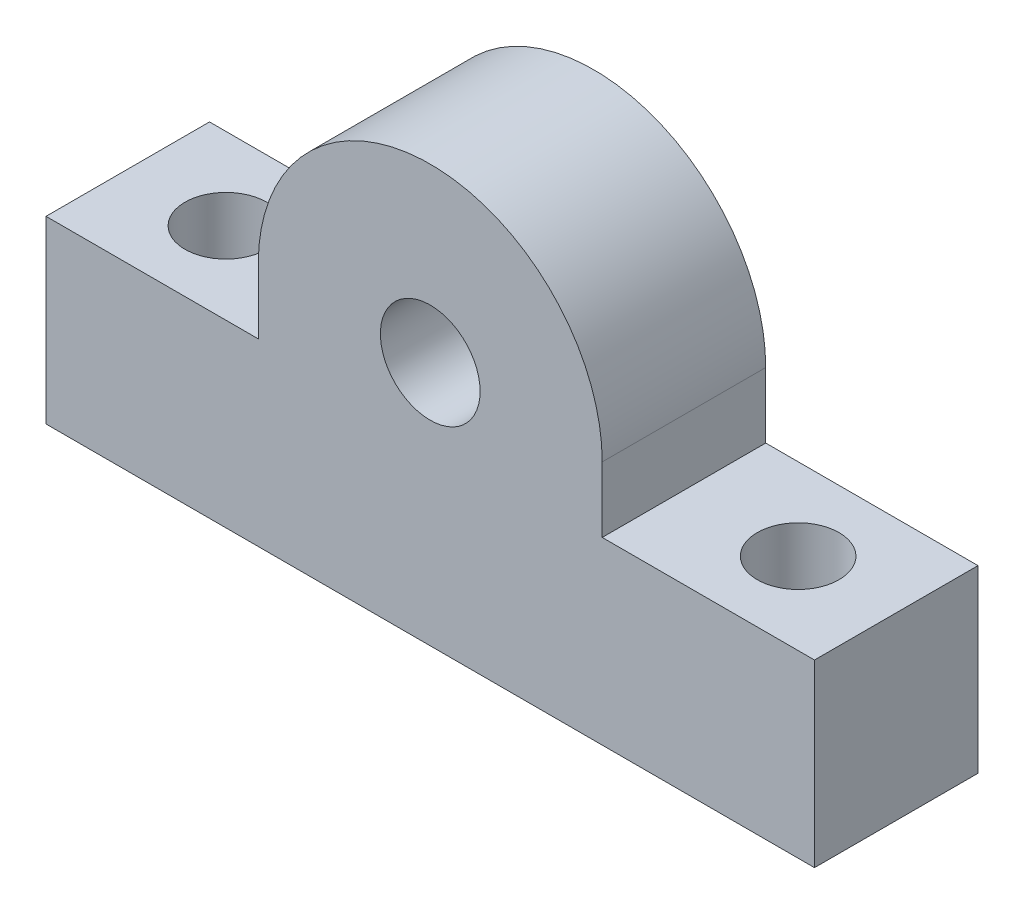
ISO-10303-21;
HEADER;
FILE_DESCRIPTION(('STEP AP214'),'2;1');
FILE_NAME('part.step','',(''),(''),'','','');
FILE_SCHEMA(('AUTOMOTIVE_DESIGN { 1 0 10303 214 1 1 1 1 }'));
ENDSEC;
DATA;
#1=APPLICATION_CONTEXT('core data for automotive mechanical design processes');
#2=APPLICATION_PROTOCOL_DEFINITION('international standard','automotive_design',2000,#1);
#3=PRODUCT_CONTEXT('',#1,'mechanical');
#4=PRODUCT('Part','Part','',(#3));
#5=PRODUCT_RELATED_PRODUCT_CATEGORY('part','',(#4));
#6=PRODUCT_DEFINITION_FORMATION('','',#4);
#7=PRODUCT_DEFINITION_CONTEXT('part definition',#1,'design');
#8=PRODUCT_DEFINITION('design','',#6,#7);
#9=PRODUCT_DEFINITION_SHAPE('','',#8);
#10=(LENGTH_UNIT() NAMED_UNIT(*) SI_UNIT(.MILLI.,.METRE.));
#11=(NAMED_UNIT(*) PLANE_ANGLE_UNIT() SI_UNIT($,.RADIAN.));
#12=(NAMED_UNIT(*) SI_UNIT($,.STERADIAN.) SOLID_ANGLE_UNIT());
#13=UNCERTAINTY_MEASURE_WITH_UNIT(LENGTH_MEASURE(1.E-05),#10,'distance_accuracy_value','');
#14=(GEOMETRIC_REPRESENTATION_CONTEXT(3) GLOBAL_UNCERTAINTY_ASSIGNED_CONTEXT((#13)) GLOBAL_UNIT_ASSIGNED_CONTEXT((#10,
#11,#12)) REPRESENTATION_CONTEXT('',''));
#15=CARTESIAN_POINT('',(0.,0.,0.));
#16=DIRECTION('',(0.,0.,1.));
#17=DIRECTION('',(1.,0.,0.));
#18=AXIS2_PLACEMENT_3D('',#15,#16,#17);
#19=CARTESIAN_POINT('',(-23.5,5.5,10.));
#20=DIRECTION('',(0.,-1.,0.));
#21=DIRECTION('',(0.,0.,-1.));
#22=AXIS2_PLACEMENT_3D('',#19,#20,#21);
#23=PLANE('',#22);
#24=CARTESIAN_POINT('',(-17.5,5.5,5.));
#25=DIRECTION('',(0.,-1.,0.));
#26=DIRECTION('',(0.,0.,-1.));
#27=AXIS2_PLACEMENT_3D('',#24,#25,#26);
#28=CIRCLE('',#27,2.5);
#29=CARTESIAN_POINT('',(-17.5,5.5,2.5));
#30=VERTEX_POINT('',#29);
#31=EDGE_CURVE('E158',#30,#30,#28,.F.);
#32=ORIENTED_EDGE('',*,*,#31,.F.);
#33=EDGE_LOOP('',(#32));
#34=FACE_BOUND('',#33,.T.);
#35=DIRECTION('',(0.,0.,1.));
#36=VECTOR('',#35,1.);
#37=CARTESIAN_POINT('',(-10.5173777166829,5.5,0.));
#38=LINE('',#37,#36);
#39=CARTESIAN_POINT('',(-10.5173777166829,5.5,0.));
#40=VERTEX_POINT('',#39);
#41=CARTESIAN_POINT('',(-10.5173777166829,5.5,10.));
#42=VERTEX_POINT('',#41);
#43=EDGE_CURVE('E152',#40,#42,#38,.T.);
#44=ORIENTED_EDGE('',*,*,#43,.F.);
#45=DIRECTION('',(-1.,0.,0.));
#46=VECTOR('',#45,1.);
#47=CARTESIAN_POINT('',(-23.5,5.5,0.));
#48=LINE('',#47,#46);
#49=CARTESIAN_POINT('',(-23.5,5.5,0.));
#50=VERTEX_POINT('',#49);
#51=EDGE_CURVE('E177',#40,#50,#48,.T.);
#52=ORIENTED_EDGE('',*,*,#51,.T.);
#53=DIRECTION('',(0.,0.,-1.));
#54=VECTOR('',#53,1.);
#55=CARTESIAN_POINT('',(-23.5,5.5,10.));
#56=LINE('',#55,#54);
#57=CARTESIAN_POINT('',(-23.5,5.5,10.));
#58=VERTEX_POINT('',#57);
#59=EDGE_CURVE('E49',#58,#50,#56,.T.);
#60=ORIENTED_EDGE('',*,*,#59,.F.);
#61=DIRECTION('',(-1.,0.,0.));
#62=VECTOR('',#61,1.);
#63=CARTESIAN_POINT('',(-23.5,5.5,10.));
#64=LINE('',#63,#62);
#65=EDGE_CURVE('E169',#42,#58,#64,.T.);
#66=ORIENTED_EDGE('',*,*,#65,.F.);
#67=EDGE_LOOP('',(#44,#52,#60,#66));
#68=FACE_BOUND('',#67,.T.);
#69=ADVANCED_FACE('F41',(#34,#68),#23,.F.);
#70=CARTESIAN_POINT('',(23.5,5.5,0.));
#71=VERTEX_POINT('',#70);
#72=CARTESIAN_POINT('',(10.5173777166829,5.5,0.));
#73=VERTEX_POINT('',#72);
#74=EDGE_CURVE('E178',#71,#73,#48,.T.);
#75=ORIENTED_EDGE('',*,*,#74,.T.);
#76=DIRECTION('',(0.,0.,1.));
#77=VECTOR('',#76,1.);
#78=CARTESIAN_POINT('',(10.5173777166829,5.5,0.));
#79=LINE('',#78,#77);
#80=CARTESIAN_POINT('',(10.5173777166829,5.5,10.));
#81=VERTEX_POINT('',#80);
#82=EDGE_CURVE('E128',#73,#81,#79,.T.);
#83=ORIENTED_EDGE('',*,*,#82,.T.);
#84=CARTESIAN_POINT('',(23.5,5.5,10.));
#85=VERTEX_POINT('',#84);
#86=EDGE_CURVE('E92',#85,#81,#64,.T.);
#87=ORIENTED_EDGE('',*,*,#86,.F.);
#88=DIRECTION('',(0.,0.,-1.));
#89=VECTOR('',#88,1.);
#90=CARTESIAN_POINT('',(23.5,5.5,10.));
#91=LINE('',#90,#89);
#92=EDGE_CURVE('E11',#85,#71,#91,.T.);
#93=ORIENTED_EDGE('',*,*,#92,.T.);
#94=EDGE_LOOP('',(#75,#83,#87,#93));
#95=FACE_BOUND('',#94,.T.);
#96=CARTESIAN_POINT('',(17.5,5.5,5.));
#97=DIRECTION('',(0.,-1.,0.));
#98=DIRECTION('',(0.,0.,-1.));
#99=AXIS2_PLACEMENT_3D('',#96,#97,#98);
#100=CIRCLE('',#99,2.5);
#101=CARTESIAN_POINT('',(17.5,5.5,2.5));
#102=VERTEX_POINT('',#101);
#103=EDGE_CURVE('E151',#102,#102,#100,.T.);
#104=ORIENTED_EDGE('',*,*,#103,.T.);
#105=EDGE_LOOP('',(#104));
#106=FACE_BOUND('',#105,.T.);
#107=ADVANCED_FACE('F200',(#95,#106),#23,.F.);
#108=CARTESIAN_POINT('',(-23.5,-5.5,10.));
#109=DIRECTION('',(0.,1.,0.));
#110=DIRECTION('',(0.,0.,1.));
#111=AXIS2_PLACEMENT_3D('',#108,#109,#110);
#112=PLANE('',#111);
#113=DIRECTION('',(1.,0.,0.));
#114=VECTOR('',#113,1.);
#115=CARTESIAN_POINT('',(-23.5,-5.5,0.));
#116=LINE('',#115,#114);
#117=CARTESIAN_POINT('',(-23.5,-5.5,0.));
#118=VERTEX_POINT('',#117);
#119=CARTESIAN_POINT('',(23.5,-5.5,0.));
#120=VERTEX_POINT('',#119);
#121=EDGE_CURVE('E86',#118,#120,#116,.T.);
#122=ORIENTED_EDGE('',*,*,#121,.T.);
#123=DIRECTION('',(0.,0.,-1.));
#124=VECTOR('',#123,1.);
#125=CARTESIAN_POINT('',(23.5,-5.5,10.));
#126=LINE('',#125,#124);
#127=CARTESIAN_POINT('',(23.5,-5.5,10.));
#128=VERTEX_POINT('',#127);
#129=EDGE_CURVE('E174',#128,#120,#126,.T.);
#130=ORIENTED_EDGE('',*,*,#129,.F.);
#131=DIRECTION('',(1.,0.,0.));
#132=VECTOR('',#131,1.);
#133=CARTESIAN_POINT('',(-23.5,-5.5,10.));
#134=LINE('',#133,#132);
#135=CARTESIAN_POINT('',(-23.5,-5.5,10.));
#136=VERTEX_POINT('',#135);
#137=EDGE_CURVE('E65',#136,#128,#134,.T.);
#138=ORIENTED_EDGE('',*,*,#137,.F.);
#139=DIRECTION('',(0.,0.,-1.));
#140=VECTOR('',#139,1.);
#141=CARTESIAN_POINT('',(-23.5,-5.5,10.));
#142=LINE('',#141,#140);
#143=EDGE_CURVE('E184',#136,#118,#142,.T.);
#144=ORIENTED_EDGE('',*,*,#143,.T.);
#145=EDGE_LOOP('',(#122,#130,#138,#144));
#146=FACE_BOUND('',#145,.T.);
#147=CARTESIAN_POINT('',(17.5,-5.5,5.));
#148=DIRECTION('',(0.,-1.,0.));
#149=DIRECTION('',(0.,0.,-1.));
#150=AXIS2_PLACEMENT_3D('',#147,#148,#149);
#151=CIRCLE('',#150,2.5);
#152=CARTESIAN_POINT('',(17.5,-5.5,2.5));
#153=VERTEX_POINT('',#152);
#154=EDGE_CURVE('E159',#153,#153,#151,.F.);
#155=ORIENTED_EDGE('',*,*,#154,.T.);
#156=EDGE_LOOP('',(#155));
#157=FACE_BOUND('',#156,.T.);
#158=CARTESIAN_POINT('',(-17.5,-5.5,5.));
#159=DIRECTION('',(0.,-1.,0.));
#160=DIRECTION('',(0.,0.,-1.));
#161=AXIS2_PLACEMENT_3D('',#158,#159,#160);
#162=CIRCLE('',#161,2.5);
#163=CARTESIAN_POINT('',(-17.5,-5.5,2.5));
#164=VERTEX_POINT('',#163);
#165=EDGE_CURVE('E155',#164,#164,#162,.T.);
#166=ORIENTED_EDGE('',*,*,#165,.F.);
#167=EDGE_LOOP('',(#166));
#168=FACE_BOUND('',#167,.T.);
#169=ADVANCED_FACE('F197',(#146,#157,#168),#112,.F.);
#170=CARTESIAN_POINT('',(23.5,5.5,10.));
#171=DIRECTION('',(-1.,0.,0.));
#172=DIRECTION('',(0.,0.,1.));
#173=AXIS2_PLACEMENT_3D('',#170,#171,#172);
#174=PLANE('',#173);
#175=DIRECTION('',(0.,1.,0.));
#176=VECTOR('',#175,1.);
#177=CARTESIAN_POINT('',(23.5,5.5,0.));
#178=LINE('',#177,#176);
#179=EDGE_CURVE('E162',#120,#71,#178,.T.);
#180=ORIENTED_EDGE('',*,*,#179,.T.);
#181=ORIENTED_EDGE('',*,*,#92,.F.);
#182=DIRECTION('',(0.,1.,0.));
#183=VECTOR('',#182,1.);
#184=CARTESIAN_POINT('',(23.5,5.5,10.));
#185=LINE('',#184,#183);
#186=EDGE_CURVE('E167',#128,#85,#185,.T.);
#187=ORIENTED_EDGE('',*,*,#186,.F.);
#188=ORIENTED_EDGE('',*,*,#129,.T.);
#189=EDGE_LOOP('',(#180,#181,#187,#188));
#190=FACE_BOUND('',#189,.T.);
#191=ADVANCED_FACE('F43',(#190),#174,.F.);
#192=CARTESIAN_POINT('',(-23.5,5.5,10.));
#193=DIRECTION('',(1.,0.,0.));
#194=DIRECTION('',(0.,0.,-1.));
#195=AXIS2_PLACEMENT_3D('',#192,#193,#194);
#196=PLANE('',#195);
#197=DIRECTION('',(0.,-1.,0.));
#198=VECTOR('',#197,1.);
#199=CARTESIAN_POINT('',(-23.5,5.5,0.));
#200=LINE('',#199,#198);
#201=EDGE_CURVE('E180',#50,#118,#200,.T.);
#202=ORIENTED_EDGE('',*,*,#201,.T.);
#203=ORIENTED_EDGE('',*,*,#143,.F.);
#204=DIRECTION('',(0.,-1.,0.));
#205=VECTOR('',#204,1.);
#206=CARTESIAN_POINT('',(-23.5,5.5,10.));
#207=LINE('',#206,#205);
#208=EDGE_CURVE('E171',#58,#136,#207,.T.);
#209=ORIENTED_EDGE('',*,*,#208,.F.);
#210=ORIENTED_EDGE('',*,*,#59,.T.);
#211=EDGE_LOOP('',(#202,#203,#209,#210));
#212=FACE_BOUND('',#211,.T.);
#213=ADVANCED_FACE('F190',(#212),#196,.F.);
#214=CARTESIAN_POINT('',(0.,0.,10.));
#215=DIRECTION('',(0.,0.,1.));
#216=DIRECTION('',(1.,0.,0.));
#217=AXIS2_PLACEMENT_3D('',#214,#215,#216);
#218=PLANE('',#217);
#219=ORIENTED_EDGE('',*,*,#186,.T.);
#220=ORIENTED_EDGE('',*,*,#86,.T.);
#221=DIRECTION('',(0.,-1.,0.));
#222=VECTOR('',#221,1.);
#223=CARTESIAN_POINT('',(10.5173777166829,0.,10.));
#224=LINE('',#223,#222);
#225=CARTESIAN_POINT('',(10.5173777166829,9.5,10.));
#226=VERTEX_POINT('',#225);
#227=EDGE_CURVE('E56',#226,#81,#224,.T.);
#228=ORIENTED_EDGE('',*,*,#227,.F.);
#229=CARTESIAN_POINT('',(0.,9.5,10.));
#230=DIRECTION('',(0.,0.,1.));
#231=DIRECTION('',(1.,0.,0.));
#232=AXIS2_PLACEMENT_3D('',#229,#230,#231);
#233=CIRCLE('',#232,10.5173777166829);
#234=CARTESIAN_POINT('',(-10.5173777166829,9.5,10.));
#235=VERTEX_POINT('',#234);
#236=EDGE_CURVE('E122',#226,#235,#233,.T.);
#237=ORIENTED_EDGE('',*,*,#236,.T.);
#238=DIRECTION('',(0.,-1.,0.));
#239=VECTOR('',#238,1.);
#240=CARTESIAN_POINT('',(-10.5173777166829,0.,10.));
#241=LINE('',#240,#239);
#242=EDGE_CURVE('E147',#235,#42,#241,.T.);
#243=ORIENTED_EDGE('',*,*,#242,.T.);
#244=ORIENTED_EDGE('',*,*,#65,.T.);
#245=ORIENTED_EDGE('',*,*,#208,.T.);
#246=ORIENTED_EDGE('',*,*,#137,.T.);
#247=EDGE_LOOP('',(#219,#220,#228,#237,#243,#244,#245,#246));
#248=FACE_BOUND('',#247,.T.);
#249=CARTESIAN_POINT('',(0.,9.5,10.));
#250=DIRECTION('',(0.,0.,1.));
#251=DIRECTION('',(1.,0.,0.));
#252=AXIS2_PLACEMENT_3D('',#249,#250,#251);
#253=CIRCLE('',#252,3.05);
#254=CARTESIAN_POINT('',(3.05,9.5,10.));
#255=VERTEX_POINT('',#254);
#256=EDGE_CURVE('E142',#255,#255,#253,.T.);
#257=ORIENTED_EDGE('',*,*,#256,.F.);
#258=EDGE_LOOP('',(#257));
#259=FACE_BOUND('',#258,.T.);
#260=ADVANCED_FACE('F218',(#248,#259),#218,.T.);
#261=CARTESIAN_POINT('',(0.,0.,0.));
#262=DIRECTION('',(0.,0.,1.));
#263=DIRECTION('',(1.,0.,0.));
#264=AXIS2_PLACEMENT_3D('',#261,#262,#263);
#265=PLANE('',#264);
#266=ORIENTED_EDGE('',*,*,#179,.F.);
#267=ORIENTED_EDGE('',*,*,#121,.F.);
#268=ORIENTED_EDGE('',*,*,#201,.F.);
#269=ORIENTED_EDGE('',*,*,#51,.F.);
#270=DIRECTION('',(0.,-1.,0.));
#271=VECTOR('',#270,1.);
#272=CARTESIAN_POINT('',(-10.5173777166829,0.,0.));
#273=LINE('',#272,#271);
#274=CARTESIAN_POINT('',(-10.5173777166829,9.5,0.));
#275=VERTEX_POINT('',#274);
#276=EDGE_CURVE('E124',#275,#40,#273,.T.);
#277=ORIENTED_EDGE('',*,*,#276,.F.);
#278=CARTESIAN_POINT('',(0.,9.5,0.));
#279=DIRECTION('',(0.,0.,1.));
#280=DIRECTION('',(1.,0.,0.));
#281=AXIS2_PLACEMENT_3D('',#278,#279,#280);
#282=CIRCLE('',#281,10.5173777166829);
#283=CARTESIAN_POINT('',(10.5173777166829,9.5,0.));
#284=VERTEX_POINT('',#283);
#285=EDGE_CURVE('E120',#284,#275,#282,.T.);
#286=ORIENTED_EDGE('',*,*,#285,.F.);
#287=DIRECTION('',(0.,-1.,0.));
#288=VECTOR('',#287,1.);
#289=CARTESIAN_POINT('',(10.5173777166829,0.,0.));
#290=LINE('',#289,#288);
#291=EDGE_CURVE('E126',#284,#73,#290,.T.);
#292=ORIENTED_EDGE('',*,*,#291,.T.);
#293=ORIENTED_EDGE('',*,*,#74,.F.);
#294=EDGE_LOOP('',(#266,#267,#268,#269,#277,#286,#292,#293));
#295=FACE_BOUND('',#294,.T.);
#296=CARTESIAN_POINT('',(0.,9.5,0.));
#297=DIRECTION('',(0.,0.,1.));
#298=DIRECTION('',(1.,0.,0.));
#299=AXIS2_PLACEMENT_3D('',#296,#297,#298);
#300=CIRCLE('',#299,3.05);
#301=CARTESIAN_POINT('',(3.05,9.5,0.));
#302=VERTEX_POINT('',#301);
#303=EDGE_CURVE('E131',#302,#302,#300,.T.);
#304=ORIENTED_EDGE('',*,*,#303,.T.);
#305=EDGE_LOOP('',(#304));
#306=FACE_BOUND('',#305,.T.);
#307=ADVANCED_FACE('F135',(#295,#306),#265,.F.);
#308=CARTESIAN_POINT('',(17.5,5.501,5.));
#309=DIRECTION('',(0.,-1.,0.));
#310=DIRECTION('',(0.,0.,-1.));
#311=AXIS2_PLACEMENT_3D('',#308,#309,#310);
#312=CYLINDRICAL_SURFACE('',#311,2.5);
#313=ORIENTED_EDGE('',*,*,#154,.F.);
#314=EDGE_LOOP('',(#313));
#315=FACE_BOUND('',#314,.T.);
#316=ORIENTED_EDGE('',*,*,#103,.F.);
#317=EDGE_LOOP('',(#316));
#318=FACE_BOUND('',#317,.T.);
#319=ADVANCED_FACE('F209',(#315,#318),#312,.F.);
#320=CARTESIAN_POINT('',(-17.5,5.501,5.));
#321=DIRECTION('',(0.,-1.,0.));
#322=DIRECTION('',(0.,0.,-1.));
#323=AXIS2_PLACEMENT_3D('',#320,#321,#322);
#324=CYLINDRICAL_SURFACE('',#323,2.5);
#325=ORIENTED_EDGE('',*,*,#165,.T.);
#326=EDGE_LOOP('',(#325));
#327=FACE_BOUND('',#326,.T.);
#328=ORIENTED_EDGE('',*,*,#31,.T.);
#329=EDGE_LOOP('',(#328));
#330=FACE_BOUND('',#329,.T.);
#331=ADVANCED_FACE('F206',(#327,#330),#324,.F.);
#332=CARTESIAN_POINT('',(10.5173777166829,0.,0.));
#333=DIRECTION('',(-1.,0.,0.));
#334=DIRECTION('',(0.,-1.,0.));
#335=AXIS2_PLACEMENT_3D('',#332,#333,#334);
#336=PLANE('',#335);
#337=ORIENTED_EDGE('',*,*,#227,.T.);
#338=ORIENTED_EDGE('',*,*,#82,.F.);
#339=ORIENTED_EDGE('',*,*,#291,.F.);
#340=DIRECTION('',(0.,0.,1.));
#341=VECTOR('',#340,1.);
#342=CARTESIAN_POINT('',(10.5173777166829,9.5,0.));
#343=LINE('',#342,#341);
#344=EDGE_CURVE('E116',#284,#226,#343,.T.);
#345=ORIENTED_EDGE('',*,*,#344,.T.);
#346=EDGE_LOOP('',(#337,#338,#339,#345));
#347=FACE_BOUND('',#346,.T.);
#348=ADVANCED_FACE('F127',(#347),#336,.F.);
#349=CARTESIAN_POINT('',(-10.5173777166829,0.,0.));
#350=DIRECTION('',(-1.,0.,0.));
#351=DIRECTION('',(0.,-1.,0.));
#352=AXIS2_PLACEMENT_3D('',#349,#350,#351);
#353=PLANE('',#352);
#354=ORIENTED_EDGE('',*,*,#242,.F.);
#355=DIRECTION('',(0.,0.,1.));
#356=VECTOR('',#355,1.);
#357=CARTESIAN_POINT('',(-10.5173777166829,9.5,0.));
#358=LINE('',#357,#356);
#359=EDGE_CURVE('E123',#275,#235,#358,.T.);
#360=ORIENTED_EDGE('',*,*,#359,.F.);
#361=ORIENTED_EDGE('',*,*,#276,.T.);
#362=ORIENTED_EDGE('',*,*,#43,.T.);
#363=EDGE_LOOP('',(#354,#360,#361,#362));
#364=FACE_BOUND('',#363,.T.);
#365=ADVANCED_FACE('F217',(#364),#353,.T.);
#366=CARTESIAN_POINT('',(0.,9.5,0.));
#367=DIRECTION('',(0.,0.,1.));
#368=DIRECTION('',(1.,0.,0.));
#369=AXIS2_PLACEMENT_3D('',#366,#367,#368);
#370=CYLINDRICAL_SURFACE('',#369,3.05);
#371=ORIENTED_EDGE('',*,*,#303,.F.);
#372=EDGE_LOOP('',(#371));
#373=FACE_BOUND('',#372,.T.);
#374=ORIENTED_EDGE('',*,*,#256,.T.);
#375=EDGE_LOOP('',(#374));
#376=FACE_BOUND('',#375,.T.);
#377=ADVANCED_FACE('F224',(#373,#376),#370,.F.);
#378=CARTESIAN_POINT('',(0.,9.5,0.));
#379=DIRECTION('',(0.,0.,1.));
#380=DIRECTION('',(1.,0.,0.));
#381=AXIS2_PLACEMENT_3D('',#378,#379,#380);
#382=CYLINDRICAL_SURFACE('',#381,10.5173777166829);
#383=ORIENTED_EDGE('',*,*,#236,.F.);
#384=ORIENTED_EDGE('',*,*,#344,.F.);
#385=ORIENTED_EDGE('',*,*,#285,.T.);
#386=ORIENTED_EDGE('',*,*,#359,.T.);
#387=EDGE_LOOP('',(#383,#384,#385,#386));
#388=FACE_BOUND('',#387,.T.);
#389=ADVANCED_FACE('F118',(#388),#382,.T.);
#390=CLOSED_SHELL('',(#69,#107,#169,#191,#213,#260,#307,#319,#331,#348,#365,#377,#389));
#391=MANIFOLD_SOLID_BREP('B2',#390);
#392=ADVANCED_BREP_SHAPE_REPRESENTATION('',(#18,#391),#14);
#393=SHAPE_DEFINITION_REPRESENTATION(#9,#392);
ENDSEC;
END-ISO-10303-21;
